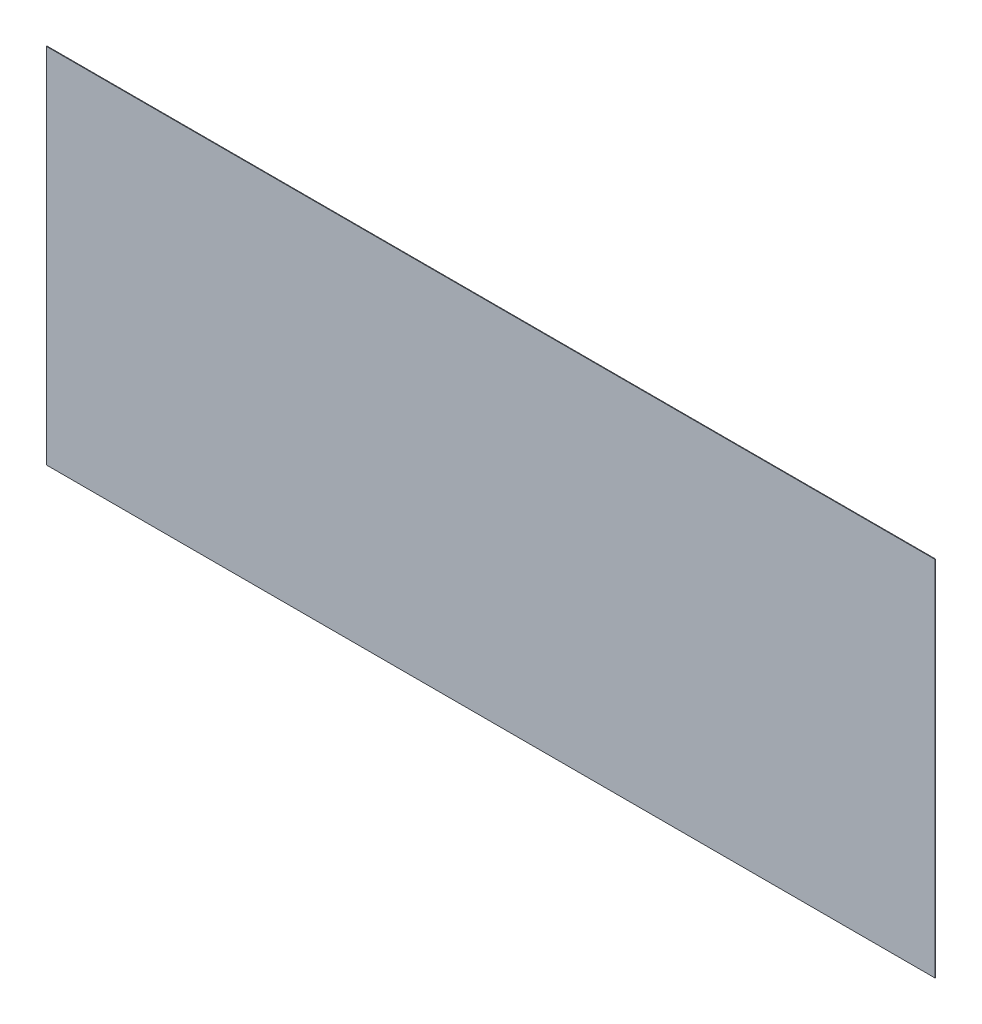
ISO-10303-21;
HEADER;
FILE_DESCRIPTION(('STEP AP214'),'2;1');
FILE_NAME('part.step','',(''),(''),'','','');
FILE_SCHEMA(('AUTOMOTIVE_DESIGN { 1 0 10303 214 1 1 1 1 }'));
ENDSEC;
DATA;
#1=APPLICATION_CONTEXT('core data for automotive mechanical design processes');
#2=APPLICATION_PROTOCOL_DEFINITION('international standard','automotive_design',2000,#1);
#3=PRODUCT_CONTEXT('',#1,'mechanical');
#4=PRODUCT('Part','Part','',(#3));
#5=PRODUCT_RELATED_PRODUCT_CATEGORY('part','',(#4));
#6=PRODUCT_DEFINITION_FORMATION('','',#4);
#7=PRODUCT_DEFINITION_CONTEXT('part definition',#1,'design');
#8=PRODUCT_DEFINITION('design','',#6,#7);
#9=PRODUCT_DEFINITION_SHAPE('','',#8);
#10=(LENGTH_UNIT() NAMED_UNIT(*) SI_UNIT(.MILLI.,.METRE.));
#11=(NAMED_UNIT(*) PLANE_ANGLE_UNIT() SI_UNIT($,.RADIAN.));
#12=(NAMED_UNIT(*) SI_UNIT($,.STERADIAN.) SOLID_ANGLE_UNIT());
#13=UNCERTAINTY_MEASURE_WITH_UNIT(LENGTH_MEASURE(1.E-05),#10,'distance_accuracy_value','');
#14=(GEOMETRIC_REPRESENTATION_CONTEXT(3) GLOBAL_UNCERTAINTY_ASSIGNED_CONTEXT((#13)) GLOBAL_UNIT_ASSIGNED_CONTEXT((#10,
#11,#12)) REPRESENTATION_CONTEXT('',''));
#15=CARTESIAN_POINT('',(0.,0.,0.));
#16=DIRECTION('',(0.,0.,1.));
#17=DIRECTION('',(1.,0.,0.));
#18=AXIS2_PLACEMENT_3D('',#15,#16,#17);
#19=CARTESIAN_POINT('',(2.584900605342E-05,-6.357779370457E-06,0.00100076));
#20=DIRECTION('',(0.,0.,1.));
#21=DIRECTION('',(1.,0.,0.));
#22=AXIS2_PLACEMENT_3D('',#19,#20,#21);
#23=PLANE('',#22);
#24=DIRECTION('',(-1.,0.,0.));
#25=VECTOR('',#24,1.);
#26=CARTESIAN_POINT('',(0.72309482,0.2950464,0.00100076));
#27=LINE('',#26,#25);
#28=CARTESIAN_POINT('',(0.72309482,0.2950464,0.00100076));
#29=VERTEX_POINT('',#28);
#30=CARTESIAN_POINT('',(-0.72299576,0.2950464,0.00100076));
#31=VERTEX_POINT('',#30);
#32=EDGE_CURVE('E94',#29,#31,#27,.T.);
#33=ORIENTED_EDGE('',*,*,#32,.T.);
#34=DIRECTION('',(-0.000163568194988355,-0.999999986622723,0.));
#35=VECTOR('',#34,1.);
#36=CARTESIAN_POINT('',(-0.72299576,0.2950464,0.00100076));
#37=LINE('',#36,#35);
#38=CARTESIAN_POINT('',(-0.72309228,-0.29504386,0.00100076));
#39=VERTEX_POINT('',#38);
#40=EDGE_CURVE('E74',#31,#39,#37,.T.);
#41=ORIENTED_EDGE('',*,*,#40,.T.);
#42=DIRECTION('',(0.999999999998458,-1.75634259379381E-06,0.));
#43=VECTOR('',#42,1.);
#44=CARTESIAN_POINT('',(-0.72309228,-0.29504386,0.00100076));
#45=LINE('',#44,#43);
#46=CARTESIAN_POINT('',(0.72309482,-0.2950464,0.00100076));
#47=VERTEX_POINT('',#46);
#48=EDGE_CURVE('E78',#39,#47,#45,.T.);
#49=ORIENTED_EDGE('',*,*,#48,.T.);
#50=DIRECTION('',(0.,1.,0.));
#51=VECTOR('',#50,1.);
#52=CARTESIAN_POINT('',(0.72309482,-0.2950464,0.00100076));
#53=LINE('',#52,#51);
#54=EDGE_CURVE('E10',#47,#29,#53,.T.);
#55=ORIENTED_EDGE('',*,*,#54,.T.);
#56=EDGE_LOOP('',(#33,#41,#49,#55));
#57=FACE_BOUND('',#56,.T.);
#58=ADVANCED_FACE('F16',(#57),#23,.T.);
#59=CARTESIAN_POINT('',(2.584900605342E-05,-6.357779370457E-06,0.));
#60=DIRECTION('',(0.,0.,1.));
#61=DIRECTION('',(1.,0.,0.));
#62=AXIS2_PLACEMENT_3D('',#59,#60,#61);
#63=PLANE('',#62);
#64=DIRECTION('',(0.,1.,0.));
#65=VECTOR('',#64,1.);
#66=CARTESIAN_POINT('',(0.72309482,-0.2950464,0.));
#67=LINE('',#66,#65);
#68=CARTESIAN_POINT('',(0.72309482,-0.2950464,0.));
#69=VERTEX_POINT('',#68);
#70=CARTESIAN_POINT('',(0.72309482,0.2950464,0.));
#71=VERTEX_POINT('',#70);
#72=EDGE_CURVE('E19',#69,#71,#67,.T.);
#73=ORIENTED_EDGE('',*,*,#72,.F.);
#74=DIRECTION('',(0.999999999998458,-1.75634259379381E-06,0.));
#75=VECTOR('',#74,1.);
#76=CARTESIAN_POINT('',(-0.72309228,-0.29504386,0.));
#77=LINE('',#76,#75);
#78=CARTESIAN_POINT('',(-0.72309228,-0.29504386,0.));
#79=VERTEX_POINT('',#78);
#80=EDGE_CURVE('E64',#79,#69,#77,.T.);
#81=ORIENTED_EDGE('',*,*,#80,.F.);
#82=DIRECTION('',(-0.000163568194988355,-0.999999986622723,0.));
#83=VECTOR('',#82,1.);
#84=CARTESIAN_POINT('',(-0.72299576,0.2950464,0.));
#85=LINE('',#84,#83);
#86=CARTESIAN_POINT('',(-0.72299576,0.2950464,0.));
#87=VERTEX_POINT('',#86);
#88=EDGE_CURVE('E68',#87,#79,#85,.T.);
#89=ORIENTED_EDGE('',*,*,#88,.F.);
#90=DIRECTION('',(-1.,0.,0.));
#91=VECTOR('',#90,1.);
#92=CARTESIAN_POINT('',(0.72309482,0.2950464,0.));
#93=LINE('',#92,#91);
#94=EDGE_CURVE('E98',#71,#87,#93,.T.);
#95=ORIENTED_EDGE('',*,*,#94,.F.);
#96=EDGE_LOOP('',(#73,#81,#89,#95));
#97=FACE_BOUND('',#96,.T.);
#98=ADVANCED_FACE('F66',(#97),#63,.F.);
#99=CARTESIAN_POINT('',(0.72309482,-0.2950464,0.));
#100=DIRECTION('',(-1.,0.,0.));
#101=DIRECTION('',(0.,0.,1.));
#102=AXIS2_PLACEMENT_3D('',#99,#100,#101);
#103=PLANE('',#102);
#104=ORIENTED_EDGE('',*,*,#72,.T.);
#105=DIRECTION('',(0.,0.,1.));
#106=VECTOR('',#105,1.);
#107=CARTESIAN_POINT('',(0.72309482,0.2950464,0.));
#108=LINE('',#107,#106);
#109=EDGE_CURVE('E88',#71,#29,#108,.T.);
#110=ORIENTED_EDGE('',*,*,#109,.T.);
#111=ORIENTED_EDGE('',*,*,#54,.F.);
#112=DIRECTION('',(0.,0.,1.));
#113=VECTOR('',#112,1.);
#114=CARTESIAN_POINT('',(0.72309482,-0.2950464,0.));
#115=LINE('',#114,#113);
#116=EDGE_CURVE('E73',#69,#47,#115,.T.);
#117=ORIENTED_EDGE('',*,*,#116,.F.);
#118=EDGE_LOOP('',(#104,#110,#111,#117));
#119=FACE_BOUND('',#118,.T.);
#120=ADVANCED_FACE('F121',(#119),#103,.F.);
#121=CARTESIAN_POINT('',(-0.72309228,-0.29504386,0.));
#122=DIRECTION('',(1.75634259379381E-06,0.999999999998458,0.));
#123=DIRECTION('',(0.,0.,-1.));
#124=AXIS2_PLACEMENT_3D('',#121,#122,#123);
#125=PLANE('',#124);
#126=ORIENTED_EDGE('',*,*,#80,.T.);
#127=ORIENTED_EDGE('',*,*,#116,.T.);
#128=ORIENTED_EDGE('',*,*,#48,.F.);
#129=DIRECTION('',(0.,0.,1.));
#130=VECTOR('',#129,1.);
#131=CARTESIAN_POINT('',(-0.72309228,-0.29504386,0.));
#132=LINE('',#131,#130);
#133=EDGE_CURVE('E76',#79,#39,#132,.T.);
#134=ORIENTED_EDGE('',*,*,#133,.F.);
#135=EDGE_LOOP('',(#126,#127,#128,#134));
#136=FACE_BOUND('',#135,.T.);
#137=ADVANCED_FACE('F77',(#136),#125,.F.);
#138=CARTESIAN_POINT('',(-0.72299576,0.2950464,0.));
#139=DIRECTION('',(0.999999986622723,-0.000163568194988355,0.));
#140=DIRECTION('',(0.,0.,-1.));
#141=AXIS2_PLACEMENT_3D('',#138,#139,#140);
#142=PLANE('',#141);
#143=ORIENTED_EDGE('',*,*,#88,.T.);
#144=ORIENTED_EDGE('',*,*,#133,.T.);
#145=ORIENTED_EDGE('',*,*,#40,.F.);
#146=DIRECTION('',(0.,0.,1.));
#147=VECTOR('',#146,1.);
#148=CARTESIAN_POINT('',(-0.72299576,0.2950464,0.));
#149=LINE('',#148,#147);
#150=EDGE_CURVE('E85',#87,#31,#149,.T.);
#151=ORIENTED_EDGE('',*,*,#150,.F.);
#152=EDGE_LOOP('',(#143,#144,#145,#151));
#153=FACE_BOUND('',#152,.T.);
#154=ADVANCED_FACE('F83',(#153),#142,.F.);
#155=CARTESIAN_POINT('',(0.72309482,0.2950464,0.));
#156=DIRECTION('',(0.,-1.,0.));
#157=DIRECTION('',(0.,0.,-1.));
#158=AXIS2_PLACEMENT_3D('',#155,#156,#157);
#159=PLANE('',#158);
#160=ORIENTED_EDGE('',*,*,#94,.T.);
#161=ORIENTED_EDGE('',*,*,#150,.T.);
#162=ORIENTED_EDGE('',*,*,#32,.F.);
#163=ORIENTED_EDGE('',*,*,#109,.F.);
#164=EDGE_LOOP('',(#160,#161,#162,#163));
#165=FACE_BOUND('',#164,.T.);
#166=ADVANCED_FACE('F113',(#165),#159,.F.);
#167=CLOSED_SHELL('',(#58,#98,#120,#137,#154,#166));
#168=MANIFOLD_SOLID_BREP('B1',#167);
#169=ADVANCED_BREP_SHAPE_REPRESENTATION('',(#18,#168),#14);
#170=SHAPE_DEFINITION_REPRESENTATION(#9,#169);
ENDSEC;
END-ISO-10303-21;
